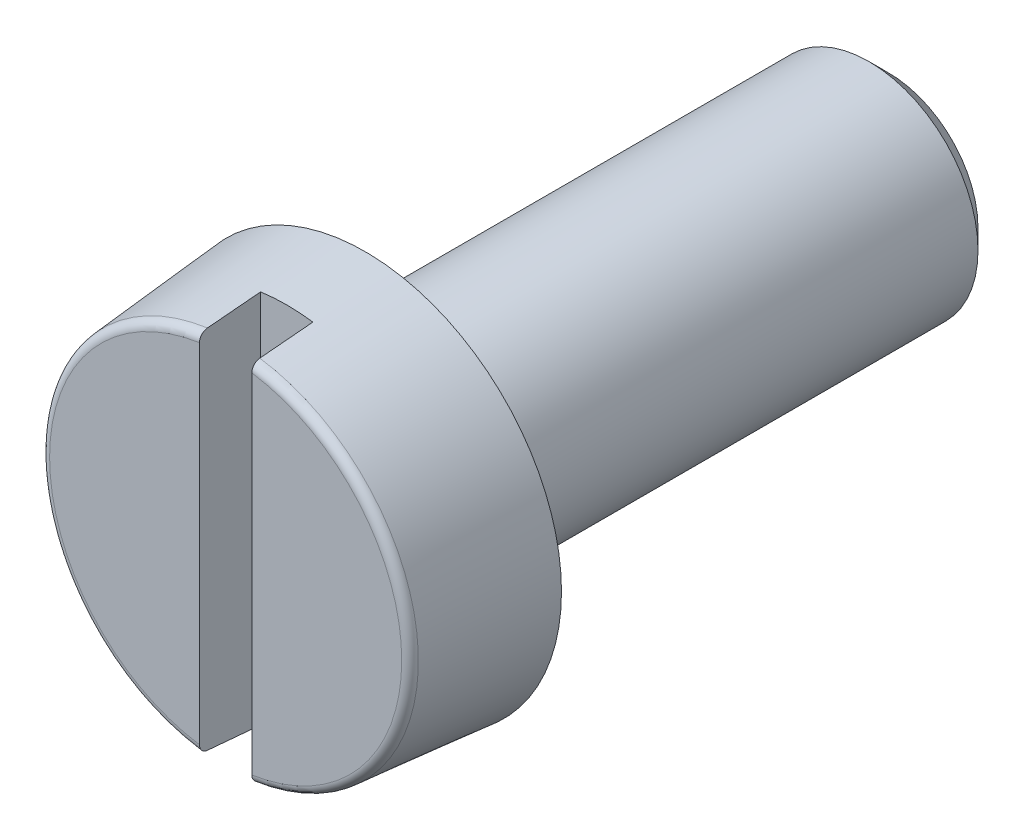
ISO-10303-21;
HEADER;
FILE_DESCRIPTION(('STEP AP214'),'2;1');
FILE_NAME('part.step','',(''),(''),'','','');
FILE_SCHEMA(('AUTOMOTIVE_DESIGN { 1 0 10303 214 1 1 1 1 }'));
ENDSEC;
DATA;
#1=APPLICATION_CONTEXT('core data for automotive mechanical design processes');
#2=APPLICATION_PROTOCOL_DEFINITION('international standard','automotive_design',2000,#1);
#3=PRODUCT_CONTEXT('',#1,'mechanical');
#4=PRODUCT('Part','Part','',(#3));
#5=PRODUCT_RELATED_PRODUCT_CATEGORY('part','',(#4));
#6=PRODUCT_DEFINITION_FORMATION('','',#4);
#7=PRODUCT_DEFINITION_CONTEXT('part definition',#1,'design');
#8=PRODUCT_DEFINITION('design','',#6,#7);
#9=PRODUCT_DEFINITION_SHAPE('','',#8);
#10=(LENGTH_UNIT() NAMED_UNIT(*) SI_UNIT(.MILLI.,.METRE.));
#11=(NAMED_UNIT(*) PLANE_ANGLE_UNIT() SI_UNIT($,.RADIAN.));
#12=(NAMED_UNIT(*) SI_UNIT($,.STERADIAN.) SOLID_ANGLE_UNIT());
#13=UNCERTAINTY_MEASURE_WITH_UNIT(LENGTH_MEASURE(1.E-05),#10,'distance_accuracy_value','');
#14=(GEOMETRIC_REPRESENTATION_CONTEXT(3) GLOBAL_UNCERTAINTY_ASSIGNED_CONTEXT((#13)) GLOBAL_UNIT_ASSIGNED_CONTEXT((#10,
#11,#12)) REPRESENTATION_CONTEXT('',''));
#15=CARTESIAN_POINT('',(0.,0.,0.));
#16=DIRECTION('',(0.,0.,1.));
#17=DIRECTION('',(1.,0.,0.));
#18=AXIS2_PLACEMENT_3D('',#15,#16,#17);
#19=CARTESIAN_POINT('',(0.,0.,0.));
#20=DIRECTION('',(0.,0.,-1.));
#21=DIRECTION('',(-1.,0.,0.));
#22=AXIS2_PLACEMENT_3D('',#19,#20,#21);
#23=PLANE('',#22);
#24=CARTESIAN_POINT('',(0.,0.,0.));
#25=DIRECTION('',(0.,0.,1.));
#26=DIRECTION('',(1.,0.,0.));
#27=AXIS2_PLACEMENT_3D('',#24,#25,#26);
#28=CIRCLE('',#27,2.01838502095677);
#29=CARTESIAN_POINT('',(0.300000000000001,-1.99596545381494,0.));
#30=VERTEX_POINT('',#29);
#31=CARTESIAN_POINT('',(0.3,1.99596545381494,0.));
#32=VERTEX_POINT('',#31);
#33=EDGE_CURVE('E183',#30,#32,#28,.T.);
#34=ORIENTED_EDGE('',*,*,#33,.T.);
#35=DIRECTION('',(0.,1.,0.));
#36=VECTOR('',#35,1.);
#37=CARTESIAN_POINT('',(0.3,2.25,0.));
#38=LINE('',#37,#36);
#39=EDGE_CURVE('E176',#30,#32,#38,.T.);
#40=ORIENTED_EDGE('',*,*,#39,.F.);
#41=EDGE_LOOP('',(#34,#40));
#42=FACE_BOUND('',#41,.T.);
#43=ADVANCED_FACE('F38',(#42),#23,.F.);
#44=CARTESIAN_POINT('',(0.,0.,-0.0999999999999997));
#45=DIRECTION('',(0.,0.,1.));
#46=DIRECTION('',(1.,0.,0.));
#47=AXIS2_PLACEMENT_3D('',#44,#45,#46);
#48=TOROIDAL_SURFACE('',#47,2.01838502095677,0.0999999999999999);
#49=ORIENTED_EDGE('',*,*,#33,.F.);
#50=CARTESIAN_POINT('',(0.300000000000001,-2.08197595897494,-0.0474736721001232));
#51=CARTESIAN_POINT('',(0.300000000000001,-2.08492725987014,-0.0522064333585621));
#52=CARTESIAN_POINT('',(0.300000000000001,-2.08748294784451,-0.0571904282171773));
#53=CARTESIAN_POINT('',(0.300000000000001,-2.09172414355833,-0.0675204387516064));
#54=CARTESIAN_POINT('',(0.300000000000001,-2.09340869215697,-0.0728668461587789));
#55=CARTESIAN_POINT('',(0.300000000000001,-2.09585411120678,-0.0837660710043663));
#56=CARTESIAN_POINT('',(0.300000000000001,-2.09661521403341,-0.0893188361523918));
#57=CARTESIAN_POINT('',(0.300000000000001,-2.09719105406608,-0.10047183420317));
#58=CARTESIAN_POINT('',(0.300000000000001,-2.09700601342122,-0.106072055655188));
#59=CARTESIAN_POINT('',(0.300000000000001,-2.09569762752883,-0.117145912960011));
#60=CARTESIAN_POINT('',(0.300000000000001,-2.09457689239275,-0.122619857459802));
#61=CARTESIAN_POINT('',(0.300000000000001,-2.09143400139962,-0.133302600752762));
#62=CARTESIAN_POINT('',(0.300000000000001,-2.08941181364134,-0.138511390155169));
#63=CARTESIAN_POINT('',(0.300000000000001,-2.08452118223255,-0.148527621452164));
#64=CARTESIAN_POINT('',(0.300000000000001,-2.08165110349929,-0.153334264647581));
#65=CARTESIAN_POINT('',(0.300000000000001,-2.07515032887845,-0.162402088132373));
#66=CARTESIAN_POINT('',(0.300000000000001,-2.07151960980507,-0.16666325178808));
#67=CARTESIAN_POINT('',(0.300000000000001,-2.06357262993628,-0.17455384838539));
#68=CARTESIAN_POINT('',(0.300000000000001,-2.05925147521961,-0.178178351472549));
#69=CARTESIAN_POINT('',(0.300000000000001,-2.05006716922364,-0.184659092496685));
#70=CARTESIAN_POINT('',(0.300000000000001,-2.04520399074264,-0.187515291851423));
#71=CARTESIAN_POINT('',(0.300000000000001,-2.03502105585923,-0.192408934562883));
#72=CARTESIAN_POINT('',(0.300000000000001,-2.0296971778197,-0.19443780172695));
#73=CARTESIAN_POINT('',(0.300000000000001,-2.01878611554469,-0.19758177041087));
#74=CARTESIAN_POINT('',(0.300000000000001,-2.01319891718662,-0.198696822861203));
#75=CARTESIAN_POINT('',(0.300000000000001,-2.00186702465778,-0.199990192958822));
#76=CARTESIAN_POINT('',(0.300000000000001,-1.99612137547282,-0.200160153048096));
#77=CARTESIAN_POINT('',(0.300000000000001,-1.9846824456278,-0.199536944261778));
#78=CARTESIAN_POINT('',(0.300000000000001,-1.97898916660839,-0.198743745315449));
#79=CARTESIAN_POINT('',(0.300000000000001,-1.9677949862043,-0.196210872467549));
#80=CARTESIAN_POINT('',(0.300000000000001,-1.96229486819509,-0.194467733005889));
#81=CARTESIAN_POINT('',(0.300000000000001,-1.95166681076233,-0.190079593589266));
#82=CARTESIAN_POINT('',(0.300000000000001,-1.94653886857472,-0.187434600332976));
#83=CARTESIAN_POINT('',(0.300000000000001,-1.93682201143139,-0.18132579674033));
#84=CARTESIAN_POINT('',(0.300000000000001,-1.93223121967206,-0.177864973036708));
#85=CARTESIAN_POINT('',(0.300000000000001,-1.92370306192699,-0.170214698806277));
#86=CARTESIAN_POINT('',(0.300000000000001,-1.91976566385828,-0.166025284075492));
#87=CARTESIAN_POINT('',(0.300000000000001,-1.91269835953486,-0.157080121504037));
#88=CARTESIAN_POINT('',(0.300000000000001,-1.90956089733443,-0.152330344441418));
#89=CARTESIAN_POINT('',(0.300000000000001,-1.90413896345417,-0.14236656840282));
#90=CARTESIAN_POINT('',(0.300000000000001,-1.90185443299181,-0.137152601448669));
#91=CARTESIAN_POINT('',(0.300000000000001,-1.89823060277161,-0.126473985418713));
#92=CARTESIAN_POINT('',(0.300000000000001,-1.89688056807611,-0.12101297824517));
#93=CARTESIAN_POINT('',(0.300000000000001,-1.89512456344617,-0.109941300366011));
#94=CARTESIAN_POINT('',(0.300000000000001,-1.8947185431724,-0.104330637656876));
#95=CARTESIAN_POINT('',(0.300000000000001,-1.89486251285339,-0.093165637086694));
#96=CARTESIAN_POINT('',(0.300000000000001,-1.8954050595265,-0.0876112016101441));
#97=CARTESIAN_POINT('',(0.300000000000001,-1.89741513270339,-0.0766724427626235));
#98=CARTESIAN_POINT('',(0.300000000000001,-1.89888264895165,-0.0712881175062654));
#99=CARTESIAN_POINT('',(0.300000000000001,-1.90269809672374,-0.0608412818168763));
#100=CARTESIAN_POINT('',(0.300000000000001,-1.90504602398842,-0.0557787698271514));
#101=CARTESIAN_POINT('',(0.300000000000001,-1.91055221080247,-0.04611566335337));
#102=CARTESIAN_POINT('',(0.300000000000001,-1.9137104959635,-0.0415150834752441));
#103=CARTESIAN_POINT('',(0.300000000000001,-1.92077245014382,-0.0328673874657778));
#104=CARTESIAN_POINT('',(0.300000000000001,-1.92468168289275,-0.0288248161058408));
#105=CARTESIAN_POINT('',(0.300000000000001,-1.93311648383069,-0.0214441619506921));
#106=CARTESIAN_POINT('',(0.300000000000001,-1.93764208956599,-0.0181061221035422));
#107=CARTESIAN_POINT('',(0.300000000000001,-1.94723716689098,-0.0121884258875202));
#108=CARTESIAN_POINT('',(0.300000000000001,-1.95231232095485,-0.00961798280627582));
#109=CARTESIAN_POINT('',(0.300000000000001,-1.96281914561666,-0.00535594905276494));
#110=CARTESIAN_POINT('',(0.300000000000001,-1.96825083763143,-0.003664411229811));
#111=CARTESIAN_POINT('',(0.300000000000001,-1.97937472700162,-0.00119235626057636));
#112=CARTESIAN_POINT('',(0.300000000000001,-1.98506898161722,-0.000421089739810357));
#113=CARTESIAN_POINT('',(0.300000000000001,-1.99650618165435,0.000158752085021491));
#114=CARTESIAN_POINT('',(0.300000000000001,-2.0022491267724,-3.26666148446986E-05));
#115=CARTESIAN_POINT('',(0.300000000000001,-2.01364444353386,-0.00137628961391894));
#116=CARTESIAN_POINT('',(0.300000000000001,-2.01929637333134,-0.00253224698530138));
#117=CARTESIAN_POINT('',(0.300000000000001,-2.03032641098451,-0.00578011008514073));
#118=CARTESIAN_POINT('',(0.300000000000001,-2.0357044529796,-0.0078722397582399));
#119=CARTESIAN_POINT('',(0.300000000000001,-2.04601451091475,-0.0129285005433864));
#120=CARTESIAN_POINT('',(0.300000000000001,-2.0509477364344,-0.0158901675493073));
#121=CARTESIAN_POINT('',(0.300000000000001,-2.06023652304461,-0.0226047334686054));
#122=CARTESIAN_POINT('',(0.300000000000001,-2.06459279585255,-0.0263566424649547));
#123=CARTESIAN_POINT('',(0.300000000000001,-2.07112493974999,-0.0330343031002264));
#124=CARTESIAN_POINT('',(0.300000000000001,-2.07351315477506,-0.0357557934953131));
#125=CARTESIAN_POINT('',(0.300000000000001,-2.07798169194548,-0.0414408608698609));
#126=CARTESIAN_POINT('',(0.300000000000001,-2.08006201556617,-0.0444044366891996));
#127=CARTESIAN_POINT('',(0.300000000000001,-2.08197595897494,-0.0474736721001232));
#128=B_SPLINE_CURVE_WITH_KNOTS('',3,(#50,#51,#52,#53,#54,#55,#56,#57,#58,#59,#60,#61,#62,#63,
#64,#65,#66,#67,#68,#69,#70,#71,#72,#73,#74,#75,#76,#77,#78,#79,#80,#81,#82,#83,#84,#85,#86,#87,
#88,#89,#90,#91,#92,#93,#94,#95,#96,#97,#98,#99,#100,#101,#102,#103,#104,#105,#106,#107,#108,
#109,#110,#111,#112,#113,#114,#115,#116,#117,#118,#119,#120,#121,#122,#123,#124,#125,#126,#127),
.UNSPECIFIED.,.T.,.F.,(4,2,2,2,2,2,2,2,2,2,2,2,2,2,2,2,2,2,2,2,2,2,2,2,2,2,2,2,2,2,2,2,2,2,2,2,
2,2,4),(0.,0.0167195916660071,0.0334575529318585,0.0501913013910081,0.0669211210415653,
0.0836044283277344,0.100288326061245,0.117004609600728,0.133721402759527,0.150562422330257,
0.167404287455907,0.184416551254977,0.201429728509355,0.21859311878278,0.235757044927292,
0.252984011591886,0.270210850303033,0.287375577568724,0.304539461761326,0.321534653944133,
0.338528674632135,0.355324085033604,0.372118599803554,0.38878192098656,0.405445057419671,
0.422108113242756,0.438771695772773,0.455563863631527,0.472357054841097,0.489344381377263,
0.506332729257488,0.523490443934925,0.54064805174597,0.557872733764818,0.575101538357104,
0.59228198337779,0.609441033524396,0.620283881050488,0.631126676618507),.UNSPECIFIED.);
#129=CARTESIAN_POINT('',(0.300000000000001,-2.0966504293527,-0.0912844257252252));
#130=VERTEX_POINT('',#129);
#131=EDGE_CURVE('E151',#30,#130,#128,.T.);
#132=ORIENTED_EDGE('',*,*,#131,.T.);
#133=CARTESIAN_POINT('',(0.,0.,-0.0912844257252335));
#134=DIRECTION('',(0.,0.,1.));
#135=DIRECTION('',(1.,0.,0.));
#136=AXIS2_PLACEMENT_3D('',#133,#134,#135);
#137=CIRCLE('',#136,2.11800449076595);
#138=CARTESIAN_POINT('',(0.3,2.0966504293527,-0.0912844257252252));
#139=VERTEX_POINT('',#138);
#140=EDGE_CURVE('E114',#130,#139,#137,.T.);
#141=ORIENTED_EDGE('',*,*,#140,.T.);
#142=CARTESIAN_POINT('',(0.3,1.90544001660459,-0.0553392160388247));
#143=CARTESIAN_POINT('',(0.3,1.90293195401072,-0.0603032380226835));
#144=CARTESIAN_POINT('',(0.3,1.90083918098537,-0.0654813638164528));
#145=CARTESIAN_POINT('',(0.3,1.89755043805065,-0.0761193963724329));
#146=CARTESIAN_POINT('',(0.3,1.89635544361585,-0.0815796027650297));
#147=CARTESIAN_POINT('',(0.3,1.89490138320156,-0.0926223290582886));
#148=CARTESIAN_POINT('',(0.3,1.89464206774042,-0.0982048159556471));
#149=CARTESIAN_POINT('',(0.3,1.89506696774474,-0.109332345971132));
#150=CARTESIAN_POINT('',(0.3,1.89575096696785,-0.11487739737806));
#151=CARTESIAN_POINT('',(0.3,1.89803850176782,-0.12576169060833));
#152=CARTESIAN_POINT('',(0.3,1.89964003071153,-0.131101354506659));
#153=CARTESIAN_POINT('',(0.3,1.90371276486669,-0.141438040002015));
#154=CARTESIAN_POINT('',(0.3,1.90618401246854,-0.146435044883531));
#155=CARTESIAN_POINT('',(0.3,1.91193635138319,-0.155970859698007));
#156=CARTESIAN_POINT('',(0.3,1.91522119949283,-0.160507402441692));
#157=CARTESIAN_POINT('',(0.3,1.92249851586358,-0.168971943194015));
#158=CARTESIAN_POINT('',(0.3,1.92649101907408,-0.172899911128632));
#159=CARTESIAN_POINT('',(0.3,1.93511500003399,-0.180080550364082));
#160=CARTESIAN_POINT('',(0.3,1.93975278466922,-0.183325646312885));
#161=CARTESIAN_POINT('',(0.3,1.94950242459315,-0.189001395757655));
#162=CARTESIAN_POINT('',(0.3,1.9546143085366,-0.191431999984401));
#163=CARTESIAN_POINT('',(0.3,1.96522909591705,-0.195437640949008));
#164=CARTESIAN_POINT('',(0.3,1.97073576169171,-0.197002710796913));
#165=CARTESIAN_POINT('',(0.3,1.98193297364628,-0.199193282312146));
#166=CARTESIAN_POINT('',(0.3,1.9876235284147,-0.199818740029975));
#167=CARTESIAN_POINT('',(0.3,1.99906887484055,-0.20011416516284));
#168=CARTESIAN_POINT('',(0.3,2.00482383879301,-0.199777509095804));
#169=CARTESIAN_POINT('',(0.3,2.01619567696168,-0.198142711368573));
#170=CARTESIAN_POINT('',(0.3,2.02181254986296,-0.196844560556578));
#171=CARTESIAN_POINT('',(0.3,2.03274640150161,-0.193321339215673));
#172=CARTESIAN_POINT('',(0.3,2.03806345051931,-0.191096486944669));
#173=CARTESIAN_POINT('',(0.3,2.04824496977542,-0.185779779622272));
#174=CARTESIAN_POINT('',(0.3,2.05310945322324,-0.182687949886656));
#175=CARTESIAN_POINT('',(0.3,2.06221134651389,-0.175746319003886));
#176=CARTESIAN_POINT('',(0.3,2.06645279832768,-0.171901819028265));
#177=CARTESIAN_POINT('',(0.3,2.07422191841954,-0.163548801938515));
#178=CARTESIAN_POINT('',(0.3,2.07774962537514,-0.159040320828126));
#179=CARTESIAN_POINT('',(0.3,2.08395307255579,-0.149536185087054));
#180=CARTESIAN_POINT('',(0.3,2.08663707111254,-0.144545920693602));
#181=CARTESIAN_POINT('',(0.3,2.09112026942581,-0.13418261155887));
#182=CARTESIAN_POINT('',(0.3,2.09291951773621,-0.128809587841428));
#183=CARTESIAN_POINT('',(0.3,2.09556620634836,-0.117886081679468));
#184=CARTESIAN_POINT('',(0.3,2.09642218735122,-0.112337667513771));
#185=CARTESIAN_POINT('',(0.3,2.09718575531122,-0.101176029004208));
#186=CARTESIAN_POINT('',(0.3,2.09709337440817,-0.0955628068631127));
#187=CARTESIAN_POINT('',(0.3,2.09596568362219,-0.0844579787497472));
#188=CARTESIAN_POINT('',(0.3,2.09493468412645,-0.0789659342773786));
#189=CARTESIAN_POINT('',(0.3,2.09196672013276,-0.0682324825073282));
#190=CARTESIAN_POINT('',(0.3,2.09002975621873,-0.0629910750481047));
#191=CARTESIAN_POINT('',(0.3,2.08530341629824,-0.0528974178029828));
#192=CARTESIAN_POINT('',(0.3,2.08251263681727,-0.0480458254866129));
#193=CARTESIAN_POINT('',(0.3,2.07616169487882,-0.0388756550149846));
#194=CARTESIAN_POINT('',(0.3,2.07260150954244,-0.0345570927158088));
#195=CARTESIAN_POINT('',(0.3,2.06478627180299,-0.0265413969105432));
#196=CARTESIAN_POINT('',(0.3,2.0605263919229,-0.0228489711209717));
#197=CARTESIAN_POINT('',(0.3,2.0514524619838,-0.0162231806336059));
#198=CARTESIAN_POINT('',(0.3,2.04663838247689,-0.0132898562982737));
#199=CARTESIAN_POINT('',(0.3,2.03654088542663,-0.00823420382497204));
#200=CARTESIAN_POINT('',(0.3,2.03125322926216,-0.00612034117679982));
#201=CARTESIAN_POINT('',(0.3,2.02040000210688,-0.00280139099460816));
#202=CARTESIAN_POINT('',(0.3,2.01483441587299,-0.00159635336362836));
#203=CARTESIAN_POINT('',(0.3,2.00352966273849,-0.000119439967114354));
#204=CARTESIAN_POINT('',(0.3,1.99778938392283,0.000143933205650255));
#205=CARTESIAN_POINT('',(0.3,1.98634567810354,-0.000292563421718885));
#206=CARTESIAN_POINT('',(0.3,1.98064225090991,-0.000992428251092478));
#207=CARTESIAN_POINT('',(0.3,1.96941089827237,-0.00334102091336329));
#208=CARTESIAN_POINT('',(0.3,1.96388374142855,-0.00499342748842663));
#209=CARTESIAN_POINT('',(0.3,1.95318508082423,-0.00920616440165136));
#210=CARTESIAN_POINT('',(0.3,1.94801366329779,-0.0117667139614206));
#211=CARTESIAN_POINT('',(0.3,1.93819232359377,-0.0177171733744569));
#212=CARTESIAN_POINT('',(0.3,1.93354099689577,-0.0211047668380865));
#213=CARTESIAN_POINT('',(0.3,1.92488456756715,-0.0286175090959321));
#214=CARTESIAN_POINT('',(0.3,1.92087866275115,-0.0327417286860514));
#215=CARTESIAN_POINT('',(0.3,1.91496476685145,-0.0399764098401947));
#216=CARTESIAN_POINT('',(0.3,1.912826924972,-0.0429021636978546));
#217=CARTESIAN_POINT('',(0.3,1.90888075337798,-0.0489681180507936));
#218=CARTESIAN_POINT('',(0.3,1.90707242193817,-0.0521083174231725));
#219=CARTESIAN_POINT('',(0.3,1.90544001660459,-0.0553392160388247));
#220=B_SPLINE_CURVE_WITH_KNOTS('',3,(#142,#143,#144,#145,#146,#147,#148,#149,#150,#151,#152,
#153,#154,#155,#156,#157,#158,#159,#160,#161,#162,#163,#164,#165,#166,#167,#168,#169,#170,#171,
#172,#173,#174,#175,#176,#177,#178,#179,#180,#181,#182,#183,#184,#185,#186,#187,#188,#189,#190,
#191,#192,#193,#194,#195,#196,#197,#198,#199,#200,#201,#202,#203,#204,#205,#206,#207,#208,#209,
#210,#211,#212,#213,#214,#215,#216,#217,#218,#219),.UNSPECIFIED.,.T.,.F.,(4,2,2,2,2,2,2,2,2,2,2,
2,2,2,2,2,2,2,2,2,2,2,2,2,2,2,2,2,2,2,2,2,2,2,2,2,2,2,4),(0.,0.0166718295447784,
0.0333617476458867,0.050047215357164,0.0667288587827317,0.0833741580467832,0.100020268721107,
0.116744724492693,0.133470006475437,0.150372044137117,0.167275104031353,0.184368957109014,
0.201463609711152,0.218676229972172,0.235889014070269,0.253097746481832,0.270305976450007,
0.287397104422946,0.304487305986876,0.321404604709482,0.338320974930252,0.355082886288343,
0.371844229590111,0.388528986475228,0.405213732606459,0.421926053296258,0.438638871008917,
0.455472254584426,0.472306533030132,0.489310357901767,0.50631511637532,0.523473033928642,
0.540630862939389,0.557855404178151,0.575084106176403,0.592265096622691,0.609424565535498,
0.620275700603927,0.631126778856957),.UNSPECIFIED.);
#221=EDGE_CURVE('E145',#139,#32,#220,.T.);
#222=ORIENTED_EDGE('',*,*,#221,.T.);
#223=EDGE_LOOP('',(#49,#132,#141,#222));
#224=FACE_BOUND('',#223,.T.);
#225=ADVANCED_FACE('F165',(#224),#48,.T.);
#226=CARTESIAN_POINT('',(-0.3,1.99596545381494,0.));
#227=VERTEX_POINT('',#226);
#228=CARTESIAN_POINT('',(-0.300000000000001,-1.99596545381494,0.));
#229=VERTEX_POINT('',#228);
#230=EDGE_CURVE('E104',#227,#229,#28,.T.);
#231=ORIENTED_EDGE('',*,*,#230,.T.);
#232=DIRECTION('',(0.,-1.,0.));
#233=VECTOR('',#232,1.);
#234=CARTESIAN_POINT('',(-0.3,2.25,0.));
#235=LINE('',#234,#233);
#236=EDGE_CURVE('E108',#227,#229,#235,.T.);
#237=ORIENTED_EDGE('',*,*,#236,.F.);
#238=EDGE_LOOP('',(#231,#237));
#239=FACE_BOUND('',#238,.T.);
#240=ADVANCED_FACE('F40',(#239),#23,.F.);
#241=CARTESIAN_POINT('',(-0.3,2.0966504293527,-0.0912844257252252));
#242=VERTEX_POINT('',#241);
#243=CARTESIAN_POINT('',(-0.300000000000001,-2.0966504293527,-0.0912844257252252));
#244=VERTEX_POINT('',#243);
#245=EDGE_CURVE('E184',#242,#244,#137,.T.);
#246=ORIENTED_EDGE('',*,*,#245,.T.);
#247=CARTESIAN_POINT('',(-0.300000000000001,-2.08197595897494,-0.0474736721001232));
#248=CARTESIAN_POINT('',(-0.300000000000001,-2.07898628825364,-0.0426803426126228));
#249=CARTESIAN_POINT('',(-0.300000000000001,-2.07558635231628,-0.0381377539328933));
#250=CARTESIAN_POINT('',(-0.300000000000001,-2.06806721442898,-0.0296860039636549));
#251=CARTESIAN_POINT('',(-0.300000000000001,-2.06394707199391,-0.0257776839674734));
#252=CARTESIAN_POINT('',(-0.300000000000001,-2.05511401590728,-0.0187096673696974));
#253=CARTESIAN_POINT('',(-0.300000000000001,-2.05040164876711,-0.0155492882146029));
#254=CARTESIAN_POINT('',(-0.300000000000001,-2.04051787960452,-0.0100586223194365));
#255=CARTESIAN_POINT('',(-0.300000000000001,-2.03534659052177,-0.00772813204934482));
#256=CARTESIAN_POINT('',(-0.300000000000001,-2.0246487674418,-0.00394263313548126));
#257=CARTESIAN_POINT('',(-0.300000000000001,-2.01911983843142,-0.00249439250555427));
#258=CARTESIAN_POINT('',(-0.300000000000001,-2.00789772655983,-0.000538880517847855));
#259=CARTESIAN_POINT('',(-0.300000000000001,-2.00220452912185,-3.16929292222701E-05));
#260=CARTESIAN_POINT('',(-0.300000000000001,-1.99077001487657,2.90345273782462E-05));
#261=CARTESIAN_POINT('',(-0.300000000000001,-1.98502865860895,-0.000424637095254874));
#262=CARTESIAN_POINT('',(-0.300000000000001,-1.97370307212548,-0.00228784747168175));
#263=CARTESIAN_POINT('',(-0.300000000000001,-1.9681188448664,-0.00369740420022531));
#264=CARTESIAN_POINT('',(-0.300000000000001,-1.95725859423662,-0.00743727093877901));
#265=CARTESIAN_POINT('',(-0.300000000000001,-1.95198302116303,-0.00976888950115377));
#266=CARTESIAN_POINT('',(-0.300000000000001,-1.94190134737736,-0.0152897640020189));
#267=CARTESIAN_POINT('',(-0.300000000000001,-1.93709523544032,-0.0184789994277736));
#268=CARTESIAN_POINT('',(-0.300000000000001,-1.92812076643989,-0.0256062193174194));
#269=CARTESIAN_POINT('',(-0.300000000000001,-1.92394881058172,-0.0295396706216276));
#270=CARTESIAN_POINT('',(-0.300000000000001,-1.91633348792481,-0.0380580904121019));
#271=CARTESIAN_POINT('',(-0.300000000000001,-1.91289007904107,-0.0426430212396354));
#272=CARTESIAN_POINT('',(-0.300000000000001,-1.90687057200467,-0.0522803457047758));
#273=CARTESIAN_POINT('',(-0.300000000000001,-1.90428532578356,-0.0573270250188978));
#274=CARTESIAN_POINT('',(-0.300000000000001,-1.90000968041037,-0.0677861988511859));
#275=CARTESIAN_POINT('',(-0.300000000000001,-1.89831922020925,-0.0731986683839694));
#276=CARTESIAN_POINT('',(-0.300000000000001,-1.89589920541572,-0.0841715226072546));
#277=CARTESIAN_POINT('',(-0.300000000000001,-1.89515924825636,-0.089729614574606));
#278=CARTESIAN_POINT('',(-0.300000000000001,-1.89462874739556,-0.100890828703971));
#279=CARTESIAN_POINT('',(-0.300000000000001,-1.89483816441478,-0.106493948993412));
#280=CARTESIAN_POINT('',(-0.300000000000001,-1.89619604674077,-0.11755342217266));
#281=CARTESIAN_POINT('',(-0.300000000000001,-1.89733929349776,-0.123010417065669));
#282=CARTESIAN_POINT('',(-0.300000000000001,-1.90052333308107,-0.133655792563179));
#283=CARTESIAN_POINT('',(-0.300000000000001,-1.902564129146,-0.138844172198362));
#284=CARTESIAN_POINT('',(-0.300000000000001,-1.90748875898199,-0.148821382977722));
#285=CARTESIAN_POINT('',(-0.300000000000001,-1.9103748622114,-0.153609093337134));
#286=CARTESIAN_POINT('',(-0.300000000000001,-1.91690274151785,-0.162637995690468));
#287=CARTESIAN_POINT('',(-0.300000000000001,-1.920544550746,-0.166879163695586));
#288=CARTESIAN_POINT('',(-0.300000000000001,-1.92851670628399,-0.174738463748936));
#289=CARTESIAN_POINT('',(-0.300000000000001,-1.93285327448092,-0.178350283443121));
#290=CARTESIAN_POINT('',(-0.300000000000001,-1.94206532944727,-0.184804631379696));
#291=CARTESIAN_POINT('',(-0.300000000000001,-1.94694084953404,-0.18764711202498));
#292=CARTESIAN_POINT('',(-0.300000000000001,-1.95715334679074,-0.192516452412752));
#293=CARTESIAN_POINT('',(-0.300000000000001,-1.96249503299585,-0.194533437618135));
#294=CARTESIAN_POINT('',(-0.300000000000001,-1.97343959329017,-0.197650461458981));
#295=CARTESIAN_POINT('',(-0.300000000000001,-1.97904248112508,-0.198750451780031));
#296=CARTESIAN_POINT('',(-0.300000000000001,-1.99040074969176,-0.200009554937292));
#297=CARTESIAN_POINT('',(-0.300000000000001,-1.99615701528114,-0.200160698984323));
#298=CARTESIAN_POINT('',(-0.300000000000001,-2.00761359608569,-0.199496280058881));
#299=CARTESIAN_POINT('',(-0.300000000000001,-2.01331391024302,-0.198680698844497));
#300=CARTESIAN_POINT('',(-0.300000000000001,-2.0245060069138,-0.196101751596816));
#301=CARTESIAN_POINT('',(-0.300000000000001,-2.02999743232085,-0.194336834292877));
#302=CARTESIAN_POINT('',(-0.300000000000001,-2.04060367339324,-0.189905239353469));
#303=CARTESIAN_POINT('',(-0.300000000000001,-2.04571849592347,-0.18723857816037));
#304=CARTESIAN_POINT('',(-0.300000000000001,-2.05539580479043,-0.181092894886811));
#305=CARTESIAN_POINT('',(-0.300000000000001,-2.0599611131572,-0.177618317967579));
#306=CARTESIAN_POINT('',(-0.300000000000001,-2.06843639948728,-0.169945146549235));
#307=CARTESIAN_POINT('',(-0.300000000000001,-2.07234640898655,-0.165746586911212));
#308=CARTESIAN_POINT('',(-0.300000000000001,-2.07935944501188,-0.156787846849686));
#309=CARTESIAN_POINT('',(-0.300000000000001,-2.08246990260138,-0.152033483889551));
#310=CARTESIAN_POINT('',(-0.300000000000001,-2.08783913004377,-0.142066177454128));
#311=CARTESIAN_POINT('',(-0.300000000000001,-2.09009798250235,-0.136853278517355));
#312=CARTESIAN_POINT('',(-0.300000000000001,-2.09367757481394,-0.126172184585535));
#313=CARTESIAN_POINT('',(-0.300000000000001,-2.09500735989951,-0.120707019637343));
#314=CARTESIAN_POINT('',(-0.300000000000001,-2.09672464997525,-0.109629087599749));
#315=CARTESIAN_POINT('',(-0.300000000000001,-2.097111953955,-0.10401628928138));
#316=CARTESIAN_POINT('',(-0.300000000000001,-2.09693271538223,-0.0928374096890693));
#317=CARTESIAN_POINT('',(-0.300000000000001,-2.09637138712245,-0.0872712409423058));
#318=CARTESIAN_POINT('',(-0.300000000000001,-2.09432179352775,-0.0763172113753771));
#319=CARTESIAN_POINT('',(-0.300000000000001,-2.09283467512658,-0.0709291386023184));
#320=CARTESIAN_POINT('',(-0.300000000000001,-2.08973591352232,-0.0625257097911738));
#321=CARTESIAN_POINT('',(-0.300000000000001,-2.08839994841474,-0.0594058363596604));
#322=CARTESIAN_POINT('',(-0.300000000000001,-2.08541724728023,-0.0533184190307746));
#323=CARTESIAN_POINT('',(-0.300000000000001,-2.08377051274167,-0.0503508744039387));
#324=CARTESIAN_POINT('',(-0.300000000000001,-2.08197595897494,-0.0474736721001232));
#325=B_SPLINE_CURVE_WITH_KNOTS('',3,(#247,#248,#249,#250,#251,#252,#253,#254,#255,#256,#257,
#258,#259,#260,#261,#262,#263,#264,#265,#266,#267,#268,#269,#270,#271,#272,#273,#274,#275,#276,
#277,#278,#279,#280,#281,#282,#283,#284,#285,#286,#287,#288,#289,#290,#291,#292,#293,#294,#295,
#296,#297,#298,#299,#300,#301,#302,#303,#304,#305,#306,#307,#308,#309,#310,#311,#312,#313,#314,
#315,#316,#317,#318,#319,#320,#321,#322,#323,#324),.UNSPECIFIED.,.T.,.F.,(4,2,2,2,2,2,2,2,2,2,2,
2,2,2,2,2,2,2,2,2,2,2,2,2,2,2,2,2,2,2,2,2,2,2,2,2,2,2,4),(0.,0.0169352438740224,
0.0338927702195494,0.0508347613263926,0.0677725945483456,0.0848387786377895,0.10190648182463,
0.119102736159093,0.136299313866039,0.153520384338512,0.17074104294892,0.187860000626917,
0.204977969146915,0.221907114375592,0.238835104421654,0.255576205699952,0.272316614339669,
0.28896410693255,0.305611659594952,0.32230432340279,0.338997719634665,0.355849958081744,
0.372703238896991,0.389752607484073,0.406802874307576,0.423996146596755,0.44118974332469,
0.458411521126024,0.475632984922914,0.492761848952297,0.509889888425819,0.526852459966421,
0.543813385714124,0.560606791112819,0.577403777860351,0.594108737556751,0.610793043048957,
0.620958494052658,0.631123896372085),.UNSPECIFIED.);
#326=EDGE_CURVE('E152',#244,#229,#325,.T.);
#327=ORIENTED_EDGE('',*,*,#326,.T.);
#328=ORIENTED_EDGE('',*,*,#230,.F.);
#329=CARTESIAN_POINT('',(-0.3,1.90544001660459,-0.0553392160388247));
#330=CARTESIAN_POINT('',(-0.3,1.90798415456884,-0.0503049274163778));
#331=CARTESIAN_POINT('',(-0.3,1.91095923625122,-0.0454835082658797));
#332=CARTESIAN_POINT('',(-0.3,1.91768163584522,-0.0364065622694461));
#333=CARTESIAN_POINT('',(-0.3,1.92142997580176,-0.0321517967655846));
#334=CARTESIAN_POINT('',(-0.3,1.92958250794348,-0.0243338035027355));
#335=CARTESIAN_POINT('',(-0.3,1.9339860542232,-0.0207699025656139));
#336=CARTESIAN_POINT('',(-0.3,1.94332325966784,-0.0144256045519558));
#337=CARTESIAN_POINT('',(-0.3,1.94825678929964,-0.0116450166251579));
#338=CARTESIAN_POINT('',(-0.3,1.95856034731939,-0.00691877448585993));
#339=CARTESIAN_POINT('',(-0.3,1.96393376991516,-0.00498051941890536));
#340=CARTESIAN_POINT('',(-0.3,1.97492853646256,-0.00202528353573557));
#341=CARTESIAN_POINT('',(-0.3,1.98054990311398,-0.00100838725616249));
#342=CARTESIAN_POINT('',(-0.3,1.99192975731189,8.13627626662337E-05));
#343=CARTESIAN_POINT('',(-0.3,1.99768898847938,0.000146466166167646));
#344=CARTESIAN_POINT('',(-0.3,2.00913698911827,-0.000689652634035866));
#345=CARTESIAN_POINT('',(-0.3,2.01482575740629,-0.00159089104483577));
#346=CARTESIAN_POINT('',(-0.3,2.02597851838597,-0.00433814614073874));
#347=CARTESIAN_POINT('',(-0.3,2.03144220697131,-0.00618539849751681));
#348=CARTESIAN_POINT('',(-0.3,2.04197931557126,-0.010776041044641));
#349=CARTESIAN_POINT('',(-0.3,2.04705274495965,-0.0135194097024833));
#350=CARTESIAN_POINT('',(-0.3,2.05663362355845,-0.019809424647112));
#351=CARTESIAN_POINT('',(-0.3,2.06114410422286,-0.0233514520190673));
#352=CARTESIAN_POINT('',(-0.3,2.06949900502591,-0.0311493164010784));
#353=CARTESIAN_POINT('',(-0.3,2.07334345821496,-0.0354051179707289));
#354=CARTESIAN_POINT('',(-0.3,2.08021678564697,-0.0444653400367651));
#355=CARTESIAN_POINT('',(-0.3,2.08325326672401,-0.0492639895259909));
#356=CARTESIAN_POINT('',(-0.3,2.08846831525698,-0.0593068179810279));
#357=CARTESIAN_POINT('',(-0.3,2.09064693182627,-0.064550971420517));
#358=CARTESIAN_POINT('',(-0.3,2.09406321868684,-0.0752813021872707));
#359=CARTESIAN_POINT('',(-0.3,2.09530978926839,-0.0807646468349205));
#360=CARTESIAN_POINT('',(-0.3,2.0968587498308,-0.0918630585373488));
#361=CARTESIAN_POINT('',(-0.3,2.09716117697825,-0.0974781203982605));
#362=CARTESIAN_POINT('',(-0.3,2.09681374447232,-0.108646358013963));
#363=CARTESIAN_POINT('',(-0.3,2.09616932759979,-0.114199704027387));
#364=CARTESIAN_POINT('',(-0.3,2.09395751668619,-0.125119327012594));
#365=CARTESIAN_POINT('',(-0.3,2.09239013021858,-0.130485605518984));
#366=CARTESIAN_POINT('',(-0.3,2.08837845908268,-0.140881629937096));
#367=CARTESIAN_POINT('',(-0.3,2.08593387648724,-0.14591126082179));
#368=CARTESIAN_POINT('',(-0.3,2.08024000412016,-0.155492134156548));
#369=CARTESIAN_POINT('',(-0.3,2.07699069433693,-0.160043364705964));
#370=CARTESIAN_POINT('',(-0.3,2.06975913388038,-0.168569506118085));
#371=CARTESIAN_POINT('',(-0.3,2.06577244700301,-0.172540653430088));
#372=CARTESIAN_POINT('',(-0.3,2.0571946369849,-0.179765125909492));
#373=CARTESIAN_POINT('',(-0.3,2.05260348468268,-0.183018416424765));
#374=CARTESIAN_POINT('',(-0.3,2.04289921128342,-0.188748885294101));
#375=CARTESIAN_POINT('',(-0.3,2.03778142479003,-0.191218162725064));
#376=CARTESIAN_POINT('',(-0.3,2.02720664448397,-0.195271757446375));
#377=CARTESIAN_POINT('',(-0.3,2.02174963203452,-0.196856026067245));
#378=CARTESIAN_POINT('',(-0.3,2.01059539823856,-0.199109355099306));
#379=CARTESIAN_POINT('',(-0.3,2.00489637939164,-0.199769522445686));
#380=CARTESIAN_POINT('',(-0.3,1.99346802963372,-0.200129259457993));
#381=CARTESIAN_POINT('',(-0.3,1.98773869758116,-0.199828792686676));
#382=CARTESIAN_POINT('',(-0.3,1.97638042772544,-0.198271461958668));
#383=CARTESIAN_POINT('',(-0.3,1.97075218188168,-0.197009543851229));
#384=CARTESIAN_POINT('',(-0.3,1.95978785986552,-0.193557226149068));
#385=CARTESIAN_POINT('',(-0.3,1.95445178530457,-0.191366821433941));
#386=CARTESIAN_POINT('',(-0.3,1.94423440177209,-0.18612118397705));
#387=CARTESIAN_POINT('',(-0.3,1.93935233437522,-0.183067429261795));
#388=CARTESIAN_POINT('',(-0.3,1.93017584789456,-0.176177017928444));
#389=CARTESIAN_POINT('',(-0.3,1.92588140662166,-0.172340390885733));
#390=CARTESIAN_POINT('',(-0.3,1.91804245306211,-0.16402700848018));
#391=CARTESIAN_POINT('',(-0.3,1.91449186479955,-0.1595559837576));
#392=CARTESIAN_POINT('',(-0.3,1.90820246388083,-0.15007556547377));
#393=CARTESIAN_POINT('',(-0.3,1.90546356440625,-0.145066229568569));
#394=CARTESIAN_POINT('',(-0.3,1.90090918342433,-0.134715061336213));
#395=CARTESIAN_POINT('',(-0.3,1.89908313428071,-0.129377877633304));
#396=CARTESIAN_POINT('',(-0.3,1.89636209050254,-0.118469678269733));
#397=CARTESIAN_POINT('',(-0.3,1.89546727689974,-0.112898617362358));
#398=CARTESIAN_POINT('',(-0.3,1.89464071065878,-0.101735641424595));
#399=CARTESIAN_POINT('',(-0.3,1.89470053391006,-0.0961443436537289));
#400=CARTESIAN_POINT('',(-0.3,1.89576115828609,-0.08505659525578));
#401=CARTESIAN_POINT('',(-0.3,1.89676077808932,-0.0795600343762006));
#402=CARTESIAN_POINT('',(-0.3,1.89909296805383,-0.070935485655247));
#403=CARTESIAN_POINT('',(-0.3,1.90013933605004,-0.0677272688162387));
#404=CARTESIAN_POINT('',(-0.3,1.9025524838763,-0.0614337542534027));
#405=CARTESIAN_POINT('',(-0.3,1.9039192613831,-0.0583484556385019));
#406=CARTESIAN_POINT('',(-0.3,1.90544001660459,-0.0553392160388247));
#407=B_SPLINE_CURVE_WITH_KNOTS('',3,(#329,#330,#331,#332,#333,#334,#335,#336,#337,#338,#339,
#340,#341,#342,#343,#344,#345,#346,#347,#348,#349,#350,#351,#352,#353,#354,#355,#356,#357,#358,
#359,#360,#361,#362,#363,#364,#365,#366,#367,#368,#369,#370,#371,#372,#373,#374,#375,#376,#377,
#378,#379,#380,#381,#382,#383,#384,#385,#386,#387,#388,#389,#390,#391,#392,#393,#394,#395,#396,
#397,#398,#399,#400,#401,#402,#403,#404,#405,#406),.UNSPECIFIED.,.T.,.F.,(4,2,2,2,2,2,2,2,2,2,2,
2,2,2,2,2,2,2,2,2,2,2,2,2,2,2,2,2,2,2,2,2,2,2,2,2,2,2,4),(0.,0.0169093989858726,
0.0338412926353518,0.050756603997569,0.0676677904580159,0.0847246633666843,0.10178310112154,
0.118980367040493,0.136177921389562,0.153397996482764,0.170617657830496,0.187740176270969,
0.204861844793578,0.221816105305937,0.238769395033644,0.255558651010835,0.272347246064063,
0.289039711350244,0.305732039667854,0.322430042670808,0.339128460953728,0.355930816275537,
0.372733982497309,0.389701471161126,0.406669892829802,0.423800512551019,0.440931782051342,
0.45815373380013,0.475375780525552,0.49256852038114,0.509760610848847,0.526806267480786,
0.543850100246608,0.560691770289848,0.577536713734519,0.594233093268267,0.610908513522303,
0.621016158474431,0.631123730139699),.UNSPECIFIED.);
#408=EDGE_CURVE('E168',#227,#242,#407,.T.);
#409=ORIENTED_EDGE('',*,*,#408,.T.);
#410=EDGE_LOOP('',(#246,#327,#328,#409));
#411=FACE_BOUND('',#410,.T.);
#412=ADVANCED_FACE('F161',(#411),#48,.T.);
#413=CARTESIAN_POINT('',(0.,0.,-1.6));
#414=DIRECTION('',(0.,0.,-1.));
#415=DIRECTION('',(-1.,0.,0.));
#416=AXIS2_PLACEMENT_3D('',#413,#414,#415);
#417=CONICAL_SURFACE('',#416,2.25,0.0872664625997198);
#418=CARTESIAN_POINT('',(0.,0.,-0.7));
#419=DIRECTION('',(0.,0.,1.));
#420=DIRECTION('',(1.,0.,0.));
#421=AXIS2_PLACEMENT_3D('',#418,#419,#420);
#422=CIRCLE('',#421,2.17126020282666);
#423=CARTESIAN_POINT('',(0.3,2.15043504165527,-0.7));
#424=VERTEX_POINT('',#423);
#425=CARTESIAN_POINT('',(-0.3,2.15043504165527,-0.7));
#426=VERTEX_POINT('',#425);
#427=EDGE_CURVE('E106',#424,#426,#422,.T.);
#428=ORIENTED_EDGE('',*,*,#427,.F.);
#429=CARTESIAN_POINT('',(0.3,2.46639390794698,-4.28117226668541));
#430=CARTESIAN_POINT('',(0.3,2.40875381801547,-3.62717173622411));
#431=CARTESIAN_POINT('',(0.3,2.3510859619953,-2.97317365128492));
#432=CARTESIAN_POINT('',(0.3,2.23567711867118,-1.66518394825906));
#433=CARTESIAN_POINT('',(0.3,2.17793613136878,-1.01119233017225));
#434=CARTESIAN_POINT('',(0.3,2.06236342340603,0.296782897014252));
#435=CARTESIAN_POINT('',(0.3,2.00453170274483,0.950766506113869));
#436=CARTESIAN_POINT('',(0.3,1.88874841051742,2.25872312793239));
#437=CARTESIAN_POINT('',(0.3,1.83079683894866,2.91269614065107));
#438=CARTESIAN_POINT('',(0.3,1.77277078410879,3.56666255067076));
#439=B_SPLINE_CURVE_WITH_KNOTS('',3,(#429,#430,#431,#432,#433,#434,#435,#436,#437,#438),
.UNSPECIFIED.,.F.,.F.,(4,2,2,2,4),(0.,1.9696069838369,3.93921392621249,5.90882088707809,
7.87842788975049),.UNSPECIFIED.);
#440=EDGE_CURVE('E11',#424,#139,#439,.T.);
#441=ORIENTED_EDGE('',*,*,#440,.T.);
#442=ORIENTED_EDGE('',*,*,#140,.F.);
#443=CARTESIAN_POINT('',(0.300000000000001,-1.77277078410879,3.56666255067076));
#444=CARTESIAN_POINT('',(0.300000000000001,-1.87021172098538,2.46842044884326));
#445=CARTESIAN_POINT('',(0.300000000000001,-1.96745209967129,1.37016058668617));
#446=CARTESIAN_POINT('',(0.300000000000001,-2.0830872809674,0.0621908660418408));
#447=CARTESIAN_POINT('',(0.300000000000001,-2.10162096012094,-0.147506711941854));
#448=CARTESIAN_POINT('',(0.300000000000001,-2.23572186015802,-1.66518000718899));
#449=CARTESIAN_POINT('',(0.300000000000001,-2.35110479929398,-2.9731720133031));
#450=CARTESIAN_POINT('',(0.300000000000001,-2.46639390794698,-4.28117226668541));
#451=B_SPLINE_CURVE_WITH_KNOTS('',3,(#443,#444,#445,#446,#447,#448,#449,#450),.UNSPECIFIED.,.F.,
.F.,(4,2,2,4),(0.,3.3076689105762,3.93921395491729,7.87842787497246),.UNSPECIFIED.);
#452=CARTESIAN_POINT('',(0.300000000000001,-2.15043504165527,-0.7));
#453=VERTEX_POINT('',#452);
#454=EDGE_CURVE('E67',#130,#453,#451,.T.);
#455=ORIENTED_EDGE('',*,*,#454,.T.);
#456=CARTESIAN_POINT('',(-0.300000000000001,-2.15043504165527,-0.7));
#457=VERTEX_POINT('',#456);
#458=EDGE_CURVE('E97',#457,#453,#422,.T.);
#459=ORIENTED_EDGE('',*,*,#458,.F.);
#460=CARTESIAN_POINT('',(-0.300000000000001,-2.46639390794698,-4.28117226668541));
#461=CARTESIAN_POINT('',(-0.300000000000001,-2.40875381801547,-3.62717173622411));
#462=CARTESIAN_POINT('',(-0.300000000000001,-2.3510859619953,-2.97317365128492));
#463=CARTESIAN_POINT('',(-0.300000000000001,-2.23567711867118,-1.66518394825906));
#464=CARTESIAN_POINT('',(-0.300000000000001,-2.17793613136878,-1.01119233017225));
#465=CARTESIAN_POINT('',(-0.300000000000001,-2.06236342340603,0.296782897014252));
#466=CARTESIAN_POINT('',(-0.300000000000001,-2.00453170274483,0.95076650611387));
#467=CARTESIAN_POINT('',(-0.300000000000001,-1.88874841051742,2.25872312793239));
#468=CARTESIAN_POINT('',(-0.300000000000001,-1.83079683894866,2.91269614065107));
#469=CARTESIAN_POINT('',(-0.300000000000001,-1.77277078410879,3.56666255067076));
#470=B_SPLINE_CURVE_WITH_KNOTS('',3,(#460,#461,#462,#463,#464,#465,#466,#467,#468,#469),
.UNSPECIFIED.,.F.,.F.,(4,2,2,2,4),(0.,1.9696069838369,3.93921392621249,5.90882088707809,
7.87842788975049),.UNSPECIFIED.);
#471=EDGE_CURVE('E103',#457,#244,#470,.T.);
#472=ORIENTED_EDGE('',*,*,#471,.T.);
#473=ORIENTED_EDGE('',*,*,#245,.F.);
#474=CARTESIAN_POINT('',(-0.3,1.77277078410879,3.56666255067076));
#475=CARTESIAN_POINT('',(-0.3,1.87021172098538,2.46842044884326));
#476=CARTESIAN_POINT('',(-0.3,1.96745209967129,1.37016058668617));
#477=CARTESIAN_POINT('',(-0.3,2.0830872809674,0.0621908660418408));
#478=CARTESIAN_POINT('',(-0.3,2.10162096012094,-0.147506711941854));
#479=CARTESIAN_POINT('',(-0.3,2.23572186015802,-1.66518000718899));
#480=CARTESIAN_POINT('',(-0.3,2.35110479929398,-2.9731720133031));
#481=CARTESIAN_POINT('',(-0.3,2.46639390794698,-4.28117226668541));
#482=B_SPLINE_CURVE_WITH_KNOTS('',3,(#474,#475,#476,#477,#478,#479,#480,#481),.UNSPECIFIED.,.F.,
.F.,(4,2,2,4),(0.,3.3076689105762,3.93921395491729,7.87842787497246),.UNSPECIFIED.);
#483=EDGE_CURVE('E52',#242,#426,#482,.T.);
#484=ORIENTED_EDGE('',*,*,#483,.T.);
#485=EDGE_LOOP('',(#428,#441,#442,#455,#459,#472,#473,#484));
#486=FACE_BOUND('',#485,.T.);
#487=CARTESIAN_POINT('',(0.,0.,-1.6));
#488=DIRECTION('',(0.,0.,1.));
#489=DIRECTION('',(1.,0.,0.));
#490=AXIS2_PLACEMENT_3D('',#487,#488,#489);
#491=CIRCLE('',#490,2.25);
#492=CARTESIAN_POINT('',(2.25,0.,-1.6));
#493=VERTEX_POINT('',#492);
#494=EDGE_CURVE('E190',#493,#493,#491,.T.);
#495=ORIENTED_EDGE('',*,*,#494,.T.);
#496=EDGE_LOOP('',(#495));
#497=FACE_BOUND('',#496,.T.);
#498=ADVANCED_FACE('F111',(#486,#497),#417,.T.);
#499=CARTESIAN_POINT('',(0.,2.25,-1.6));
#500=DIRECTION('',(0.,0.,1.));
#501=DIRECTION('',(1.,0.,0.));
#502=AXIS2_PLACEMENT_3D('',#499,#500,#501);
#503=PLANE('',#502);
#504=ORIENTED_EDGE('',*,*,#494,.F.);
#505=EDGE_LOOP('',(#504));
#506=FACE_BOUND('',#505,.T.);
#507=CARTESIAN_POINT('',(0.,0.,-1.6));
#508=DIRECTION('',(0.,0.,1.));
#509=DIRECTION('',(1.,0.,0.));
#510=AXIS2_PLACEMENT_3D('',#507,#508,#509);
#511=CIRCLE('',#510,1.35);
#512=CARTESIAN_POINT('',(1.35,0.,-1.6));
#513=VERTEX_POINT('',#512);
#514=EDGE_CURVE('E193',#513,#513,#511,.T.);
#515=ORIENTED_EDGE('',*,*,#514,.T.);
#516=EDGE_LOOP('',(#515));
#517=FACE_BOUND('',#516,.T.);
#518=ADVANCED_FACE('F253',(#506,#517),#503,.F.);
#519=CARTESIAN_POINT('',(0.,0.,-1.7));
#520=DIRECTION('',(0.,0.,1.));
#521=DIRECTION('',(1.,0.,0.));
#522=AXIS2_PLACEMENT_3D('',#519,#520,#521);
#523=TOROIDAL_SURFACE('',#522,1.35,0.1);
#524=ORIENTED_EDGE('',*,*,#514,.F.);
#525=EDGE_LOOP('',(#524));
#526=FACE_BOUND('',#525,.T.);
#527=CARTESIAN_POINT('',(0.,0.,-1.7));
#528=DIRECTION('',(0.,0.,1.));
#529=DIRECTION('',(1.,0.,0.));
#530=AXIS2_PLACEMENT_3D('',#527,#528,#529);
#531=CIRCLE('',#530,1.25);
#532=CARTESIAN_POINT('',(1.25,0.,-1.7));
#533=VERTEX_POINT('',#532);
#534=EDGE_CURVE('E196',#533,#533,#531,.T.);
#535=ORIENTED_EDGE('',*,*,#534,.T.);
#536=EDGE_LOOP('',(#535));
#537=FACE_BOUND('',#536,.T.);
#538=ADVANCED_FACE('F293',(#526,#537),#523,.F.);
#539=CARTESIAN_POINT('',(0.,0.,0.));
#540=DIRECTION('',(0.,0.,1.));
#541=DIRECTION('',(1.,0.,0.));
#542=AXIS2_PLACEMENT_3D('',#539,#540,#541);
#543=CYLINDRICAL_SURFACE('',#542,1.25);
#544=ORIENTED_EDGE('',*,*,#534,.F.);
#545=EDGE_LOOP('',(#544));
#546=FACE_BOUND('',#545,.T.);
#547=CARTESIAN_POINT('',(0.,0.,-7.375));
#548=DIRECTION('',(0.,0.,1.));
#549=DIRECTION('',(1.,0.,0.));
#550=AXIS2_PLACEMENT_3D('',#547,#548,#549);
#551=CIRCLE('',#550,1.25);
#552=CARTESIAN_POINT('',(1.25,0.,-7.375));
#553=VERTEX_POINT('',#552);
#554=EDGE_CURVE('E199',#553,#553,#551,.T.);
#555=ORIENTED_EDGE('',*,*,#554,.T.);
#556=EDGE_LOOP('',(#555));
#557=FACE_BOUND('',#556,.T.);
#558=ADVANCED_FACE('F211',(#546,#557),#543,.T.);
#559=CARTESIAN_POINT('',(0.,0.,-7.6));
#560=DIRECTION('',(0.,0.,1.));
#561=DIRECTION('',(1.,0.,0.));
#562=AXIS2_PLACEMENT_3D('',#559,#560,#561);
#563=CONICAL_SURFACE('',#562,1.025,0.785398163397446);
#564=ORIENTED_EDGE('',*,*,#554,.F.);
#565=EDGE_LOOP('',(#564));
#566=FACE_BOUND('',#565,.T.);
#567=CARTESIAN_POINT('',(0.,0.,-7.6));
#568=DIRECTION('',(0.,0.,1.));
#569=DIRECTION('',(1.,0.,0.));
#570=AXIS2_PLACEMENT_3D('',#567,#568,#569);
#571=CIRCLE('',#570,1.025);
#572=CARTESIAN_POINT('',(1.025,0.,-7.6));
#573=VERTEX_POINT('',#572);
#574=EDGE_CURVE('E201',#573,#573,#571,.T.);
#575=ORIENTED_EDGE('',*,*,#574,.T.);
#576=EDGE_LOOP('',(#575));
#577=FACE_BOUND('',#576,.T.);
#578=ADVANCED_FACE('F205',(#566,#577),#563,.T.);
#579=CARTESIAN_POINT('',(0.,1.025,-7.6));
#580=DIRECTION('',(0.,0.,1.));
#581=DIRECTION('',(1.,0.,0.));
#582=AXIS2_PLACEMENT_3D('',#579,#580,#581);
#583=PLANE('',#582);
#584=ORIENTED_EDGE('',*,*,#574,.F.);
#585=EDGE_LOOP('',(#584));
#586=FACE_BOUND('',#585,.T.);
#587=ADVANCED_FACE('F136',(#586),#583,.F.);
#588=CARTESIAN_POINT('',(0.3,2.25,-0.7));
#589=DIRECTION('',(1.,0.,0.));
#590=DIRECTION('',(0.,1.,0.));
#591=AXIS2_PLACEMENT_3D('',#588,#589,#590);
#592=PLANE('',#591);
#593=ORIENTED_EDGE('',*,*,#39,.T.);
#594=ORIENTED_EDGE('',*,*,#221,.F.);
#595=ORIENTED_EDGE('',*,*,#440,.F.);
#596=DIRECTION('',(0.,1.,0.));
#597=VECTOR('',#596,1.);
#598=CARTESIAN_POINT('',(0.3,2.25,-0.7));
#599=LINE('',#598,#597);
#600=EDGE_CURVE('E99',#453,#424,#599,.T.);
#601=ORIENTED_EDGE('',*,*,#600,.F.);
#602=ORIENTED_EDGE('',*,*,#454,.F.);
#603=ORIENTED_EDGE('',*,*,#131,.F.);
#604=EDGE_LOOP('',(#593,#594,#595,#601,#602,#603));
#605=FACE_BOUND('',#604,.T.);
#606=ADVANCED_FACE('F107',(#605),#592,.F.);
#607=CARTESIAN_POINT('',(-0.3,2.25,-0.7));
#608=DIRECTION('',(-1.,0.,0.));
#609=DIRECTION('',(0.,-1.,0.));
#610=AXIS2_PLACEMENT_3D('',#607,#608,#609);
#611=PLANE('',#610);
#612=ORIENTED_EDGE('',*,*,#471,.F.);
#613=DIRECTION('',(0.,-1.,0.));
#614=VECTOR('',#613,1.);
#615=CARTESIAN_POINT('',(-0.3,2.25,-0.7));
#616=LINE('',#615,#614);
#617=EDGE_CURVE('E59',#426,#457,#616,.T.);
#618=ORIENTED_EDGE('',*,*,#617,.F.);
#619=ORIENTED_EDGE('',*,*,#483,.F.);
#620=ORIENTED_EDGE('',*,*,#408,.F.);
#621=ORIENTED_EDGE('',*,*,#236,.T.);
#622=ORIENTED_EDGE('',*,*,#326,.F.);
#623=EDGE_LOOP('',(#612,#618,#619,#620,#621,#622));
#624=FACE_BOUND('',#623,.T.);
#625=ADVANCED_FACE('F135',(#624),#611,.F.);
#626=CARTESIAN_POINT('',(0.,0.,-0.7));
#627=DIRECTION('',(0.,0.,1.));
#628=DIRECTION('',(1.,0.,0.));
#629=AXIS2_PLACEMENT_3D('',#626,#627,#628);
#630=PLANE('',#629);
#631=ORIENTED_EDGE('',*,*,#427,.T.);
#632=ORIENTED_EDGE('',*,*,#617,.T.);
#633=ORIENTED_EDGE('',*,*,#458,.T.);
#634=ORIENTED_EDGE('',*,*,#600,.T.);
#635=EDGE_LOOP('',(#631,#632,#633,#634));
#636=FACE_BOUND('',#635,.T.);
#637=ADVANCED_FACE('F98',(#636),#630,.T.);
#638=CLOSED_SHELL('',(#43,#225,#240,#412,#498,#518,#538,#558,#578,#587,#606,#625,#637));
#639=MANIFOLD_SOLID_BREP('B2',#638);
#640=ADVANCED_BREP_SHAPE_REPRESENTATION('',(#18,#639),#14);
#641=SHAPE_DEFINITION_REPRESENTATION(#9,#640);
ENDSEC;
END-ISO-10303-21;
